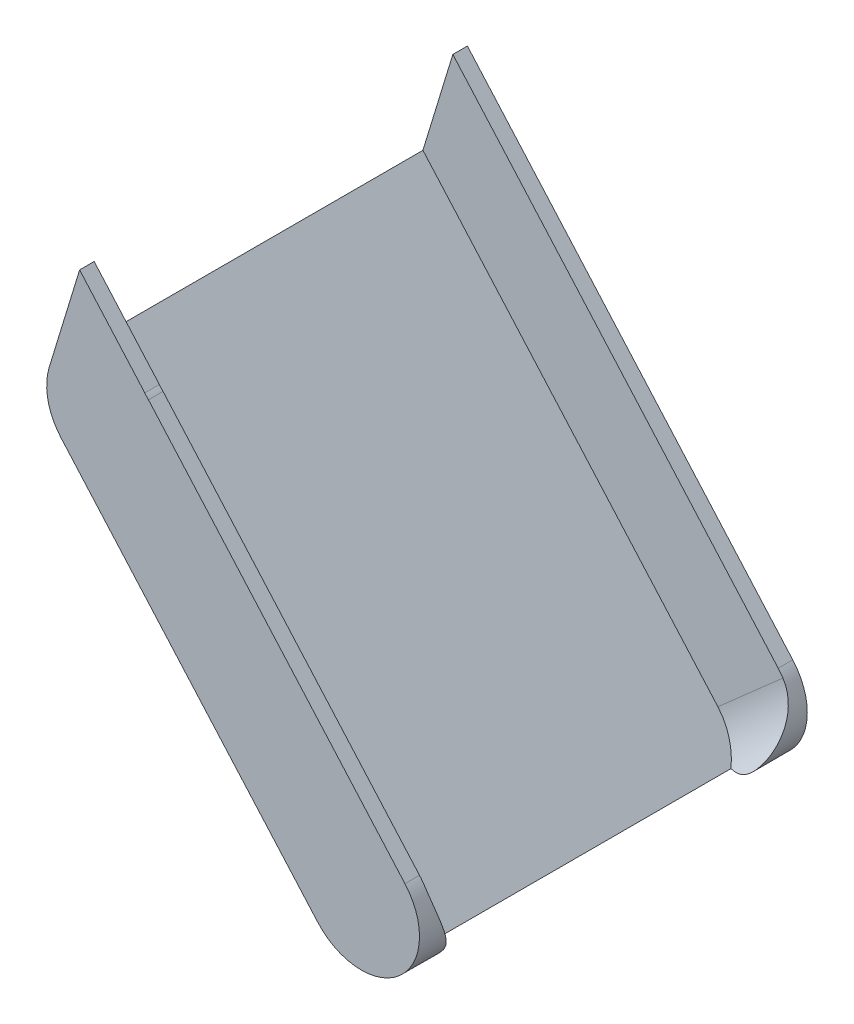
ISO-10303-21;
HEADER;
FILE_DESCRIPTION(('STEP AP214'),'2;1');
FILE_NAME('part.step','',(''),(''),'','','');
FILE_SCHEMA(('AUTOMOTIVE_DESIGN { 1 0 10303 214 1 1 1 1 }'));
ENDSEC;
DATA;
#1=APPLICATION_CONTEXT('core data for automotive mechanical design processes');
#2=APPLICATION_PROTOCOL_DEFINITION('international standard','automotive_design',2000,#1);
#3=PRODUCT_CONTEXT('',#1,'mechanical');
#4=PRODUCT('Part','Part','',(#3));
#5=PRODUCT_RELATED_PRODUCT_CATEGORY('part','',(#4));
#6=PRODUCT_DEFINITION_FORMATION('','',#4);
#7=PRODUCT_DEFINITION_CONTEXT('part definition',#1,'design');
#8=PRODUCT_DEFINITION('design','',#6,#7);
#9=PRODUCT_DEFINITION_SHAPE('','',#8);
#10=(LENGTH_UNIT() NAMED_UNIT(*) SI_UNIT(.MILLI.,.METRE.));
#11=(NAMED_UNIT(*) PLANE_ANGLE_UNIT() SI_UNIT($,.RADIAN.));
#12=(NAMED_UNIT(*) SI_UNIT($,.STERADIAN.) SOLID_ANGLE_UNIT());
#13=UNCERTAINTY_MEASURE_WITH_UNIT(LENGTH_MEASURE(1.E-05),#10,'distance_accuracy_value','');
#14=(GEOMETRIC_REPRESENTATION_CONTEXT(3) GLOBAL_UNCERTAINTY_ASSIGNED_CONTEXT((#13)) GLOBAL_UNIT_ASSIGNED_CONTEXT((#10,
#11,#12)) REPRESENTATION_CONTEXT('',''));
#15=CARTESIAN_POINT('',(0.,0.,0.));
#16=DIRECTION('',(0.,0.,1.));
#17=DIRECTION('',(1.,0.,0.));
#18=AXIS2_PLACEMENT_3D('',#15,#16,#17);
#19=CARTESIAN_POINT('',(0.,0.,200.));
#20=DIRECTION('',(0.,0.,-1.));
#21=DIRECTION('',(-1.,0.,0.));
#22=AXIS2_PLACEMENT_3D('',#19,#20,#21);
#23=CYLINDRICAL_SURFACE('',#22,30.);
#24=CARTESIAN_POINT('',(0.,0.,192.5));
#25=DIRECTION('',(0.,0.,1.));
#26=DIRECTION('',(0.,-1.,0.));
#27=AXIS2_PLACEMENT_3D('',#24,#25,#26);
#28=CIRCLE('',#27,30.);
#29=CARTESIAN_POINT('',(22.5,19.8431348329845,192.5));
#30=VERTEX_POINT('',#29);
#31=CARTESIAN_POINT('',(20.481002419258,21.9209611993258,192.5));
#32=VERTEX_POINT('',#31);
#33=EDGE_CURVE('E262',#30,#32,#28,.T.);
#34=ORIENTED_EDGE('',*,*,#33,.T.);
#35=DIRECTION('',(0.,0.,-1.));
#36=VECTOR('',#35,1.);
#37=CARTESIAN_POINT('',(20.481002419258,21.9209611993258,200.));
#38=LINE('',#37,#36);
#39=CARTESIAN_POINT('',(20.481002419258,21.9209611993258,200.));
#40=VERTEX_POINT('',#39);
#41=EDGE_CURVE('E82',#32,#40,#38,.F.);
#42=ORIENTED_EDGE('',*,*,#41,.T.);
#43=CARTESIAN_POINT('',(0.,0.,200.));
#44=DIRECTION('',(0.,0.,1.));
#45=DIRECTION('',(1.,0.,0.));
#46=AXIS2_PLACEMENT_3D('',#43,#44,#45);
#47=CIRCLE('',#46,30.);
#48=CARTESIAN_POINT('',(22.5,19.8431348329845,200.));
#49=VERTEX_POINT('',#48);
#50=EDGE_CURVE('E270',#49,#40,#47,.T.);
#51=ORIENTED_EDGE('',*,*,#50,.F.);
#52=DIRECTION('',(0.,0.,-1.));
#53=VECTOR('',#52,1.);
#54=CARTESIAN_POINT('',(22.5,19.8431348329845,200.));
#55=LINE('',#54,#53);
#56=EDGE_CURVE('E282',#49,#30,#55,.T.);
#57=ORIENTED_EDGE('',*,*,#56,.T.);
#58=EDGE_LOOP('',(#34,#42,#51,#57));
#59=FACE_BOUND('',#58,.T.);
#60=ADVANCED_FACE('F52',(#59),#23,.T.);
#61=CARTESIAN_POINT('',(22.5,19.8431348329845,200.));
#62=DIRECTION('',(-0.75,-0.661437827766148,0.));
#63=DIRECTION('',(0.661437827766148,-0.75,0.));
#64=AXIS2_PLACEMENT_3D('',#61,#62,#63);
#65=PLANE('',#64);
#66=DIRECTION('',(0.,0.,-1.));
#67=VECTOR('',#66,1.);
#68=CARTESIAN_POINT('',(154.78756555323,-130.156865167016,200.));
#69=LINE('',#68,#67);
#70=CARTESIAN_POINT('',(154.78756555323,-130.156865167016,200.));
#71=VERTEX_POINT('',#70);
#72=CARTESIAN_POINT('',(154.78756555323,-130.156865167016,192.5));
#73=VERTEX_POINT('',#72);
#74=EDGE_CURVE('E299',#71,#73,#69,.T.);
#75=ORIENTED_EDGE('',*,*,#74,.T.);
#76=DIRECTION('',(-0.661437827766148,0.75,0.));
#77=VECTOR('',#76,1.);
#78=CARTESIAN_POINT('',(22.5,19.8431348329845,192.5));
#79=LINE('',#78,#77);
#80=EDGE_CURVE('E315',#73,#30,#79,.T.);
#81=ORIENTED_EDGE('',*,*,#80,.T.);
#82=ORIENTED_EDGE('',*,*,#56,.F.);
#83=DIRECTION('',(-0.661437827766148,0.75,0.));
#84=VECTOR('',#83,1.);
#85=CARTESIAN_POINT('',(22.5,19.8431348329845,200.));
#86=LINE('',#85,#84);
#87=EDGE_CURVE('E279',#71,#49,#86,.T.);
#88=ORIENTED_EDGE('',*,*,#87,.F.);
#89=EDGE_LOOP('',(#75,#81,#82,#88));
#90=FACE_BOUND('',#89,.T.);
#91=ADVANCED_FACE('F360',(#90),#65,.F.);
#92=CARTESIAN_POINT('',(-28.6921965574017,8.76115612869827,200.));
#93=VERTEX_POINT('',#92);
#94=CARTESIAN_POINT('',(-22.5,-19.8431348329844,200.));
#95=VERTEX_POINT('',#94);
#96=EDGE_CURVE('E74',#93,#95,#47,.T.);
#97=ORIENTED_EDGE('',*,*,#96,.F.);
#98=DIRECTION('',(0.,0.,-1.));
#99=VECTOR('',#98,1.);
#100=CARTESIAN_POINT('',(-28.6921965574017,8.76115612869826,200.));
#101=LINE('',#100,#99);
#102=CARTESIAN_POINT('',(-28.6921965574017,8.76115612869826,192.5));
#103=VERTEX_POINT('',#102);
#104=EDGE_CURVE('E179',#93,#103,#101,.T.);
#105=ORIENTED_EDGE('',*,*,#104,.T.);
#106=CARTESIAN_POINT('',(0.,0.,192.5));
#107=DIRECTION('',(0.,0.,1.));
#108=DIRECTION('',(1.,0.,0.));
#109=AXIS2_PLACEMENT_3D('',#106,#107,#108);
#110=CIRCLE('',#109,30.);
#111=CARTESIAN_POINT('',(-28.4346588560844,9.56400416865766,192.5));
#112=VERTEX_POINT('',#111);
#113=EDGE_CURVE('E210',#112,#103,#110,.T.);
#114=ORIENTED_EDGE('',*,*,#113,.F.);
#115=DIRECTION('',(0.,0.,-1.));
#116=VECTOR('',#115,1.);
#117=CARTESIAN_POINT('',(-28.4346588560844,9.56400416865766,200.));
#118=LINE('',#117,#116);
#119=CARTESIAN_POINT('',(-28.4346588560844,9.56400416865766,7.49999999999998));
#120=VERTEX_POINT('',#119);
#121=EDGE_CURVE('E265',#120,#112,#118,.F.);
#122=ORIENTED_EDGE('',*,*,#121,.F.);
#123=CARTESIAN_POINT('',(0.,0.,7.5));
#124=DIRECTION('',(0.,0.,-1.));
#125=DIRECTION('',(-1.,0.,0.));
#126=AXIS2_PLACEMENT_3D('',#123,#124,#125);
#127=CIRCLE('',#126,30.);
#128=CARTESIAN_POINT('',(-28.6921965574017,8.76115612869828,7.50000000000001));
#129=VERTEX_POINT('',#128);
#130=EDGE_CURVE('E215',#129,#120,#127,.T.);
#131=ORIENTED_EDGE('',*,*,#130,.F.);
#132=DIRECTION('',(0.,0.,-1.));
#133=VECTOR('',#132,1.);
#134=CARTESIAN_POINT('',(-28.6921965574017,8.76115612869828,7.5));
#135=LINE('',#134,#133);
#136=CARTESIAN_POINT('',(-28.6921965574017,8.76115612869828,0.));
#137=VERTEX_POINT('',#136);
#138=EDGE_CURVE('E223',#129,#137,#135,.T.);
#139=ORIENTED_EDGE('',*,*,#138,.T.);
#140=CARTESIAN_POINT('',(0.,0.,0.));
#141=DIRECTION('',(0.,0.,1.));
#142=DIRECTION('',(1.,0.,0.));
#143=AXIS2_PLACEMENT_3D('',#140,#141,#142);
#144=CIRCLE('',#143,30.);
#145=CARTESIAN_POINT('',(-22.5,-19.8431348329844,0.));
#146=VERTEX_POINT('',#145);
#147=EDGE_CURVE('E269',#137,#146,#144,.T.);
#148=ORIENTED_EDGE('',*,*,#147,.T.);
#149=DIRECTION('',(0.,0.,-1.));
#150=VECTOR('',#149,1.);
#151=CARTESIAN_POINT('',(-22.5,-19.8431348329844,200.));
#152=LINE('',#151,#150);
#153=EDGE_CURVE('E307',#95,#146,#152,.T.);
#154=ORIENTED_EDGE('',*,*,#153,.F.);
#155=EDGE_LOOP('',(#97,#105,#114,#122,#131,#139,#148,#154));
#156=FACE_BOUND('',#155,.T.);
#157=ADVANCED_FACE('F54',(#156),#23,.T.);
#158=CARTESIAN_POINT('',(-22.5,-19.8431348329844,200.));
#159=DIRECTION('',(0.75,0.661437827766148,0.));
#160=DIRECTION('',(-0.661437827766148,0.75,0.));
#161=AXIS2_PLACEMENT_3D('',#158,#159,#160);
#162=PLANE('',#161);
#163=DIRECTION('',(0.661437827766148,-0.75,0.));
#164=VECTOR('',#163,1.);
#165=CARTESIAN_POINT('',(-22.5,-19.8431348329844,0.));
#166=LINE('',#165,#164);
#167=CARTESIAN_POINT('',(109.78756555323,-169.843134832984,0.));
#168=VERTEX_POINT('',#167);
#169=EDGE_CURVE('E285',#146,#168,#166,.T.);
#170=ORIENTED_EDGE('',*,*,#169,.T.);
#171=DIRECTION('',(0.,0.,-1.));
#172=VECTOR('',#171,1.);
#173=CARTESIAN_POINT('',(109.78756555323,-169.843134832984,200.));
#174=LINE('',#173,#172);
#175=CARTESIAN_POINT('',(109.78756555323,-169.843134832984,200.));
#176=VERTEX_POINT('',#175);
#177=EDGE_CURVE('E303',#176,#168,#174,.T.);
#178=ORIENTED_EDGE('',*,*,#177,.F.);
#179=DIRECTION('',(0.661437827766148,-0.75,0.));
#180=VECTOR('',#179,1.);
#181=CARTESIAN_POINT('',(-22.5,-19.8431348329844,200.));
#182=LINE('',#181,#180);
#183=EDGE_CURVE('E273',#95,#176,#182,.T.);
#184=ORIENTED_EDGE('',*,*,#183,.F.);
#185=ORIENTED_EDGE('',*,*,#153,.T.);
#186=EDGE_LOOP('',(#170,#178,#184,#185));
#187=FACE_BOUND('',#186,.T.);
#188=ADVANCED_FACE('F364',(#187),#162,.F.);
#189=CARTESIAN_POINT('',(132.28756555323,-150.,200.));
#190=DIRECTION('',(0.,0.,-1.));
#191=DIRECTION('',(-1.,0.,0.));
#192=AXIS2_PLACEMENT_3D('',#189,#190,#191);
#193=CYLINDRICAL_SURFACE('',#192,30.);
#194=CARTESIAN_POINT('',(138.222224409314,-179.407139001642,184.743459000681));
#195=CARTESIAN_POINT('',(138.548012254945,-179.341386533198,184.609437597091));
#196=CARTESIAN_POINT('',(138.873144530342,-179.270142264889,184.47657309602));
#197=CARTESIAN_POINT('',(139.522049080567,-179.116550331891,184.213882521117));
#198=CARTESIAN_POINT('',(139.84582121484,-179.034201547423,184.084056755261));
#199=CARTESIAN_POINT('',(140.81576697524,-178.770111171289,183.699931863997));
#200=CARTESIAN_POINT('',(141.45972094364,-178.571496198665,183.451338090733));
#201=CARTESIAN_POINT('',(142.746951696473,-178.125969634947,182.973678570962));
#202=CARTESIAN_POINT('',(143.390145151942,-177.878556885952,182.744854263895));
#203=CARTESIAN_POINT('',(144.666188148559,-177.335871880052,182.317769720596));
#204=CARTESIAN_POINT('',(145.299043184382,-177.040626021157,182.119492743068));
#205=CARTESIAN_POINT('',(146.446350967326,-176.455080726993,181.791771413933));
#206=CARTESIAN_POINT('',(146.962894088251,-176.172222669162,181.656360858745));
#207=CARTESIAN_POINT('',(147.983848777963,-175.5729722684,181.417312398736));
#208=CARTESIAN_POINT('',(148.488260742145,-175.256581020254,181.313673457072));
#209=CARTESIAN_POINT('',(149.479014436211,-174.592839478979,181.14287844379));
#210=CARTESIAN_POINT('',(149.96543458577,-174.2456536735,181.075540698187));
#211=CARTESIAN_POINT('',(150.91903073367,-173.520780660837,180.979625763662));
#212=CARTESIAN_POINT('',(151.386207386287,-173.143094491954,180.951047255879));
#213=CARTESIAN_POINT('',(152.299265679182,-172.358346776767,180.934007624497));
#214=CARTESIAN_POINT('',(152.74505411861,-171.951173197548,180.945708307323));
#215=CARTESIAN_POINT('',(153.609788450287,-171.112218565252,181.009003034769));
#216=CARTESIAN_POINT('',(154.02873412013,-170.680437308342,181.060597409885));
#217=CARTESIAN_POINT('',(154.838094648156,-169.794808469189,181.20140337379));
#218=CARTESIAN_POINT('',(155.228435440389,-169.340908341442,181.290708830146));
#219=CARTESIAN_POINT('',(155.977739498108,-168.415491794038,181.503061675144));
#220=CARTESIAN_POINT('',(156.33669826811,-167.943972864248,181.626113887606));
#221=CARTESIAN_POINT('',(157.124777868978,-166.843325443954,181.942378058059));
#222=CARTESIAN_POINT('',(157.542867026111,-166.209156174895,182.145568676512));
#223=CARTESIAN_POINT('',(158.324664516904,-164.921048736369,182.590219371487));
#224=CARTESIAN_POINT('',(158.688353545296,-164.267103647455,182.831692971373));
#225=CARTESIAN_POINT('',(159.362578807913,-162.942061756354,183.342983044068));
#226=CARTESIAN_POINT('',(159.673045839441,-162.270943908002,183.612835692914));
#227=CARTESIAN_POINT('',(160.241299907988,-160.914640469561,184.171476492907));
#228=CARTESIAN_POINT('',(160.499091271851,-160.229456040011,184.46026308622));
#229=CARTESIAN_POINT('',(160.97093472167,-158.82235702182,185.059078420497));
#230=CARTESIAN_POINT('',(161.183151480698,-158.099994188012,185.369496674612));
#231=CARTESIAN_POINT('',(161.552477151419,-156.643022042474,185.994354309813));
#232=CARTESIAN_POINT('',(161.709584174533,-155.908412311953,186.308793828323));
#233=CARTESIAN_POINT('',(161.96842643159,-154.428397393537,186.934663761585));
#234=CARTESIAN_POINT('',(162.07017269125,-153.682994385626,187.246094763373));
#235=CARTESIAN_POINT('',(162.217540512698,-152.182799614652,187.859547711104));
#236=CARTESIAN_POINT('',(162.263163125237,-151.42800802763,188.161569833098));
#237=CARTESIAN_POINT('',(162.297067603437,-149.90908836222,188.750769592609));
#238=CARTESIAN_POINT('',(162.285202961579,-149.144941384578,189.03790741508));
#239=CARTESIAN_POINT('',(162.202212622709,-147.611885994906,189.590366273921));
#240=CARTESIAN_POINT('',(162.131086226104,-146.842977526771,189.855687052696));
#241=CARTESIAN_POINT('',(161.928149172684,-145.305822544422,190.357757111329));
#242=CARTESIAN_POINT('',(161.796485322219,-144.537578907991,190.594573771967));
#243=CARTESIAN_POINT('',(161.471051167203,-143.00442966512,191.034277585849));
#244=CARTESIAN_POINT('',(161.277284455352,-142.239523868177,191.237166700798));
#245=CARTESIAN_POINT('',(160.842984073452,-140.773410758444,191.589894985864));
#246=CARTESIAN_POINT('',(160.606813485717,-140.07157706969,191.742499218167));
#247=CARTESIAN_POINT('',(160.080223701196,-138.680976110965,192.00884022334));
#248=CARTESIAN_POINT('',(159.789819626352,-137.992205257508,192.12258780567));
#249=CARTESIAN_POINT('',(159.312995039548,-136.970441211248,192.261511804206));
#250=CARTESIAN_POINT('',(159.146328662426,-136.630228106484,192.302650800071));
#251=CARTESIAN_POINT('',(158.799701290757,-135.955411490699,192.373619829401));
#252=CARTESIAN_POINT('',(158.619740549481,-135.62080787296,192.403450078242));
#253=CARTESIAN_POINT('',(158.24664264774,-134.957687153639,192.451441220103));
#254=CARTESIAN_POINT('',(158.053491121132,-134.629177200073,192.469589158241));
#255=CARTESIAN_POINT('',(157.654590462422,-133.979400794097,192.493875758576));
#256=CARTESIAN_POINT('',(157.448840110345,-133.658135047294,192.500013255869));
#257=CARTESIAN_POINT('',(157.237009712174,-133.340911304645,192.5));
#258=B_SPLINE_CURVE_WITH_KNOTS('',3,(#194,#195,#196,#197,#198,#199,#200,#201,#202,#203,#204,
#205,#206,#207,#208,#209,#210,#211,#212,#213,#214,#215,#216,#217,#218,#219,#220,#221,#222,#223,
#224,#225,#226,#227,#228,#229,#230,#231,#232,#233,#234,#235,#236,#237,#238,#239,#240,#241,#242,
#243,#244,#245,#246,#247,#248,#249,#250,#251,#252,#253,#254,#255,#256,#257),.UNSPECIFIED.,.F.,
.F.,(4,2,2,2,2,2,2,2,2,2,2,2,2,2,2,2,2,2,2,2,2,2,2,2,2,2,2,2,2,2,2,4),(0.,1.07499202071178,
2.15009252462735,4.30309358128589,6.47948020403126,8.65466979435197,10.4658298380934,
12.2769307696713,14.0788816272408,15.8807711682297,17.6899075519009,19.4990589233498,
21.3127402918419,23.1266810464817,25.4819700214579,27.8380928575815,30.1972564153398,
32.5562261104931,34.9973263611785,37.438510258812,39.8792077891466,42.3198596238748,
44.7667347796928,47.2136388216453,49.6546400442074,52.0955000783567,54.3609002265948,
56.6256696531129,57.7685180715639,58.9113447231833,60.0554365178529,61.1996392733974),.UNSPECIFIED.);
#259=CARTESIAN_POINT('',(138.222224409314,-179.407139001642,184.743459000682));
#260=VERTEX_POINT('',#259);
#261=CARTESIAN_POINT('',(157.237009712174,-133.340911304645,192.5));
#262=VERTEX_POINT('',#261);
#263=EDGE_CURVE('E67',#260,#262,#258,.T.);
#264=ORIENTED_EDGE('',*,*,#263,.T.);
#265=CARTESIAN_POINT('',(132.28756555323,-150.,192.5));
#266=DIRECTION('',(0.,0.,1.));
#267=DIRECTION('',(0.,-1.,0.));
#268=AXIS2_PLACEMENT_3D('',#265,#266,#267);
#269=CIRCLE('',#268,30.);
#270=EDGE_CURVE('E258',#262,#73,#269,.T.);
#271=ORIENTED_EDGE('',*,*,#270,.T.);
#272=ORIENTED_EDGE('',*,*,#74,.F.);
#273=CARTESIAN_POINT('',(132.28756555323,-150.,200.));
#274=DIRECTION('',(0.,0.,1.));
#275=DIRECTION('',(1.,0.,0.));
#276=AXIS2_PLACEMENT_3D('',#273,#274,#275);
#277=CIRCLE('',#276,30.);
#278=EDGE_CURVE('E276',#176,#71,#277,.T.);
#279=ORIENTED_EDGE('',*,*,#278,.F.);
#280=ORIENTED_EDGE('',*,*,#177,.T.);
#281=CARTESIAN_POINT('',(132.28756555323,-150.,0.));
#282=DIRECTION('',(0.,0.,1.));
#283=DIRECTION('',(1.,0.,0.));
#284=AXIS2_PLACEMENT_3D('',#281,#282,#283);
#285=CIRCLE('',#284,30.);
#286=CARTESIAN_POINT('',(154.78756555323,-130.156865167016,0.));
#287=VERTEX_POINT('',#286);
#288=EDGE_CURVE('E288',#168,#287,#285,.T.);
#289=ORIENTED_EDGE('',*,*,#288,.T.);
#290=CARTESIAN_POINT('',(154.78756555323,-130.156865167016,7.49999999999998));
#291=VERTEX_POINT('',#290);
#292=EDGE_CURVE('E298',#291,#287,#69,.T.);
#293=ORIENTED_EDGE('',*,*,#292,.F.);
#294=CARTESIAN_POINT('',(132.28756555323,-150.,7.49999999999995));
#295=DIRECTION('',(0.,0.,-1.));
#296=DIRECTION('',(0.,1.,0.));
#297=AXIS2_PLACEMENT_3D('',#294,#295,#296);
#298=CIRCLE('',#297,30.);
#299=CARTESIAN_POINT('',(157.237009712174,-133.340911304645,7.49999999999995));
#300=VERTEX_POINT('',#299);
#301=EDGE_CURVE('E251',#291,#300,#298,.T.);
#302=ORIENTED_EDGE('',*,*,#301,.T.);
#303=CARTESIAN_POINT('',(157.237009712174,-133.340911304645,7.49999999999994));
#304=CARTESIAN_POINT('',(157.441211289943,-133.646712920108,7.49998852077895));
#305=CARTESIAN_POINT('',(157.639764705172,-133.956270581635,7.50569114907807));
#306=CARTESIAN_POINT('',(158.025178779514,-134.582148542819,7.52826808463735));
#307=CARTESIAN_POINT('',(158.212040425238,-134.898468268827,7.54514144785827));
#308=CARTESIAN_POINT('',(158.573540706855,-135.5368753287,7.58978259871587));
#309=CARTESIAN_POINT('',(158.748190567238,-135.85895701509,7.61754022273261));
#310=CARTESIAN_POINT('',(159.085160237062,-136.508416714167,7.68360878414362));
#311=CARTESIAN_POINT('',(159.247479849818,-136.835794811237,7.72191988983631));
#312=CARTESIAN_POINT('',(159.713177298717,-137.819718117498,7.85146086220604));
#313=CARTESIAN_POINT('',(159.998172391533,-138.48314775819,7.95766567738335));
#314=CARTESIAN_POINT('',(160.5176820354,-139.822717675914,8.2066909082165));
#315=CARTESIAN_POINT('',(160.752186580468,-140.498860443559,8.34951856935249));
#316=CARTESIAN_POINT('',(161.169853327804,-141.856535344243,8.66721278577139));
#317=CARTESIAN_POINT('',(161.353199555201,-142.538038850227,8.8419606630567));
#318=CARTESIAN_POINT('',(161.670197591011,-143.904668022491,9.21961945824549));
#319=CARTESIAN_POINT('',(161.80385123697,-144.589793553884,9.42252933438558));
#320=CARTESIAN_POINT('',(162.022586376551,-145.961255270441,9.85251309668439));
#321=CARTESIAN_POINT('',(162.107597614176,-146.647591777724,10.0796213750981));
#322=CARTESIAN_POINT('',(162.229905537631,-148.017721022056,10.5534117553391));
#323=CARTESIAN_POINT('',(162.267199337917,-148.701513602778,10.8000950399378));
#324=CARTESIAN_POINT('',(162.296888720292,-150.144584941143,11.3386325449678));
#325=CARTESIAN_POINT('',(162.283482419591,-150.90327449713,11.6323858362497));
#326=CARTESIAN_POINT('',(162.199967437079,-152.412346793006,12.232802678746));
#327=CARTESIAN_POINT('',(162.129855275991,-153.162729020322,12.539467021044));
#328=CARTESIAN_POINT('',(161.933773962392,-154.655109107874,13.1601428709425));
#329=CARTESIAN_POINT('',(161.807677690128,-155.397083923266,13.4741695498697));
#330=CARTESIAN_POINT('',(161.500162575887,-156.869491589088,14.102211907047));
#331=CARTESIAN_POINT('',(161.318740580327,-157.599923779088,14.4162275836493));
#332=CARTESIAN_POINT('',(160.859330424358,-159.19064970699,15.0981273157432));
#333=CARTESIAN_POINT('',(160.56936263152,-160.048198288287,15.4644454155982));
#334=CARTESIAN_POINT('',(159.908864516466,-161.742713883916,16.1724812329614));
#335=CARTESIAN_POINT('',(159.538302539738,-162.57967266713,16.5141892140996));
#336=CARTESIAN_POINT('',(158.715942826284,-164.226160848823,17.1548359086578));
#337=CARTESIAN_POINT('',(158.264448906357,-165.035779815236,17.4539273139543));
#338=CARTESIAN_POINT('',(157.52494185089,-166.226306019077,17.85673913932));
#339=CARTESIAN_POINT('',(157.268133658594,-166.619069334876,17.9833463153205));
#340=CARTESIAN_POINT('',(156.733717603215,-167.395623589089,18.2187990448344));
#341=CARTESIAN_POINT('',(156.456113833129,-167.779416273699,18.3276480801827));
#342=CARTESIAN_POINT('',(155.820076844214,-168.615896187132,18.5457417371045));
#343=CARTESIAN_POINT('',(155.456879675289,-169.066209106302,18.6503100554705));
#344=CARTESIAN_POINT('',(154.701555262317,-169.948690763807,18.8257867122661));
#345=CARTESIAN_POINT('',(154.309433857542,-170.380863136891,18.8967018232881));
#346=CARTESIAN_POINT('',(153.49904703132,-171.22295241501,19.0017419194316));
#347=CARTESIAN_POINT('',(153.080839751373,-171.632915258996,19.0359458318883));
#348=CARTESIAN_POINT('',(152.220340613142,-172.428279820459,19.0662588996712));
#349=CARTESIAN_POINT('',(151.778048183541,-172.813680954844,19.06236715095));
#350=CARTESIAN_POINT('',(150.873488779126,-173.556431377676,19.0167037566736));
#351=CARTESIAN_POINT('',(150.411252098404,-173.913821038853,18.9749877598057));
#352=CARTESIAN_POINT('',(149.469816548947,-174.598968763064,18.8556477667444));
#353=CARTESIAN_POINT('',(148.990617130377,-174.926725864355,18.7780226055955));
#354=CARTESIAN_POINT('',(148.016485548558,-175.552648412751,18.5896895398523));
#355=CARTESIAN_POINT('',(147.521491802054,-175.850672661815,18.4788329438128));
#356=CARTESIAN_POINT('',(146.520840285414,-176.41484241602,18.2283251370881));
#357=CARTESIAN_POINT('',(146.015182267841,-176.680987180518,18.0886732576183));
#358=CARTESIAN_POINT('',(144.911806871322,-177.222521749375,17.7601393380237));
#359=CARTESIAN_POINT('',(144.312604074024,-177.492256679326,17.5669390696306));
#360=CARTESIAN_POINT('',(143.105440467094,-177.989283548421,17.154577059307));
#361=CARTESIAN_POINT('',(142.497476092477,-178.216557653636,16.9354044716475));
#362=CARTESIAN_POINT('',(141.280918637378,-178.627392849292,16.479967020638));
#363=CARTESIAN_POINT('',(140.67239318857,-178.811370017629,16.2438959164294));
#364=CARTESIAN_POINT('',(139.755994853618,-179.057227202419,15.8799781957576));
#365=CARTESIAN_POINT('',(139.450083964312,-179.134129947873,15.7571022677435));
#366=CARTESIAN_POINT('',(138.837051363811,-179.278034369471,15.5086753317215));
#367=CARTESIAN_POINT('',(138.529929754357,-179.345036860106,15.3831245447467));
#368=CARTESIAN_POINT('',(138.222224409314,-179.407139001642,15.2565409993184));
#369=B_SPLINE_CURVE_WITH_KNOTS('',3,(#303,#304,#305,#306,#307,#308,#309,#310,#311,#312,#313,
#314,#315,#316,#317,#318,#319,#320,#321,#322,#323,#324,#325,#326,#327,#328,#329,#330,#331,#332,
#333,#334,#335,#336,#337,#338,#339,#340,#341,#342,#343,#344,#345,#346,#347,#348,#349,#350,#351,
#352,#353,#354,#355,#356,#357,#358,#359,#360,#361,#362,#363,#364,#365,#366,#367,#368),
.UNSPECIFIED.,.F.,.F.,(4,2,2,2,2,2,2,2,2,2,2,2,2,2,2,2,2,2,2,2,2,2,2,2,2,2,2,2,2,2,2,2,4),(0.,
1.10301190067732,2.2059305976727,3.30782184285378,4.40973066112646,6.59602335174547,
8.78274891366606,10.9615039523641,13.140178416434,15.3219917271895,17.5039369691418,
19.9427264608918,22.3816655998233,24.8261712415553,27.270816246961,30.196754896639,
33.1238448324155,36.040168275003,37.4976026966259,38.954751015065,40.7165837057309,
42.478061683101,44.2357449333489,45.9934698952443,47.7486130040757,49.5038130567773,
51.2669869093538,53.0302017171246,55.0828734605914,57.1364054159412,59.1693142023253,
60.1847335087856,61.2000692304906),.UNSPECIFIED.);
#370=CARTESIAN_POINT('',(138.222224409314,-179.407139001642,15.2565409993184));
#371=VERTEX_POINT('',#370);
#372=EDGE_CURVE('E13',#300,#371,#369,.T.);
#373=ORIENTED_EDGE('',*,*,#372,.T.);
#374=DIRECTION('',(0.,0.,-1.));
#375=VECTOR('',#374,1.);
#376=CARTESIAN_POINT('',(138.222224409314,-179.407139001642,200.));
#377=LINE('',#376,#375);
#378=EDGE_CURVE('E319',#260,#371,#377,.T.);
#379=ORIENTED_EDGE('',*,*,#378,.F.);
#380=EDGE_LOOP('',(#264,#271,#272,#279,#280,#289,#293,#302,#373,#379));
#381=FACE_BOUND('',#380,.T.);
#382=ADVANCED_FACE('F328',(#381),#193,.T.);
#383=DIRECTION('',(-0.661437827766148,0.75,0.));
#384=VECTOR('',#383,1.);
#385=CARTESIAN_POINT('',(22.5,19.8431348329845,0.));
#386=LINE('',#385,#384);
#387=CARTESIAN_POINT('',(-13.0126320049643,60.1106745557652,0.));
#388=VERTEX_POINT('',#387);
#389=EDGE_CURVE('E292',#287,#388,#386,.T.);
#390=ORIENTED_EDGE('',*,*,#389,.T.);
#391=DIRECTION('',(0.,0.,-1.));
#392=VECTOR('',#391,1.);
#393=CARTESIAN_POINT('',(-13.0126320049643,60.1106745557652,7.5));
#394=LINE('',#393,#392);
#395=CARTESIAN_POINT('',(-13.0126320049643,60.1106745557652,7.5));
#396=VERTEX_POINT('',#395);
#397=EDGE_CURVE('E227',#396,#388,#394,.T.);
#398=ORIENTED_EDGE('',*,*,#397,.F.);
#399=DIRECTION('',(0.661437827766148,-0.75,0.));
#400=VECTOR('',#399,1.);
#401=CARTESIAN_POINT('',(22.5,19.8431348329845,7.49999999999998));
#402=LINE('',#401,#400);
#403=EDGE_CURVE('E311',#396,#291,#402,.T.);
#404=ORIENTED_EDGE('',*,*,#403,.T.);
#405=ORIENTED_EDGE('',*,*,#292,.T.);
#406=EDGE_LOOP('',(#390,#398,#404,#405));
#407=FACE_BOUND('',#406,.T.);
#408=ADVANCED_FACE('F355',(#407),#65,.F.);
#409=CARTESIAN_POINT('',(0.,0.,200.));
#410=DIRECTION('',(0.,0.,1.));
#411=DIRECTION('',(1.,0.,0.));
#412=AXIS2_PLACEMENT_3D('',#409,#410,#411);
#413=PLANE('',#412);
#414=ORIENTED_EDGE('',*,*,#50,.T.);
#415=DIRECTION('',(-0.966004920238332,-0.258523681846235,0.));
#416=VECTOR('',#415,1.);
#417=CARTESIAN_POINT('',(-28.6921965574017,8.76115612869826,200.));
#418=LINE('',#417,#416);
#419=CARTESIAN_POINT('',(20.6319117683024,21.9613477850695,200.));
#420=VERTEX_POINT('',#419);
#421=EDGE_CURVE('E186',#420,#40,#418,.T.);
#422=ORIENTED_EDGE('',*,*,#421,.F.);
#423=DIRECTION('',(0.661437827766148,-0.749999999999999,0.));
#424=VECTOR('',#423,1.);
#425=CARTESIAN_POINT('',(20.6319117683024,21.9613477850695,200.));
#426=LINE('',#425,#424);
#427=CARTESIAN_POINT('',(-13.0126320049642,60.1106745557652,200.));
#428=VERTEX_POINT('',#427);
#429=EDGE_CURVE('E171',#428,#420,#426,.T.);
#430=ORIENTED_EDGE('',*,*,#429,.F.);
#431=DIRECTION('',(0.292038537623276,0.956406551913389,0.));
#432=VECTOR('',#431,1.);
#433=CARTESIAN_POINT('',(-13.0126320049642,60.1106745557652,200.));
#434=LINE('',#433,#432);
#435=EDGE_CURVE('E182',#93,#428,#434,.T.);
#436=ORIENTED_EDGE('',*,*,#435,.F.);
#437=ORIENTED_EDGE('',*,*,#96,.T.);
#438=ORIENTED_EDGE('',*,*,#183,.T.);
#439=ORIENTED_EDGE('',*,*,#278,.T.);
#440=ORIENTED_EDGE('',*,*,#87,.T.);
#441=EDGE_LOOP('',(#414,#422,#430,#436,#437,#438,#439,#440));
#442=FACE_BOUND('',#441,.T.);
#443=ADVANCED_FACE('F189',(#442),#413,.T.);
#444=CARTESIAN_POINT('',(0.,0.,0.));
#445=DIRECTION('',(0.,0.,1.));
#446=DIRECTION('',(1.,0.,0.));
#447=AXIS2_PLACEMENT_3D('',#444,#445,#446);
#448=PLANE('',#447);
#449=ORIENTED_EDGE('',*,*,#147,.F.);
#450=DIRECTION('',(0.292038537623276,0.956406551913389,0.));
#451=VECTOR('',#450,1.);
#452=CARTESIAN_POINT('',(-28.6921965574017,8.76115612869828,0.));
#453=LINE('',#452,#451);
#454=EDGE_CURVE('E214',#137,#388,#453,.T.);
#455=ORIENTED_EDGE('',*,*,#454,.T.);
#456=ORIENTED_EDGE('',*,*,#389,.F.);
#457=ORIENTED_EDGE('',*,*,#288,.F.);
#458=ORIENTED_EDGE('',*,*,#169,.F.);
#459=EDGE_LOOP('',(#449,#455,#456,#457,#458));
#460=FACE_BOUND('',#459,.T.);
#461=ADVANCED_FACE('F351',(#460),#448,.F.);
#462=CARTESIAN_POINT('',(123.688733793354,-162.927709636704,42.5));
#463=DIRECTION('',(0.75,0.661437827766148,0.));
#464=DIRECTION('',(-0.661437827766148,0.75,0.));
#465=AXIS2_PLACEMENT_3D('',#462,#463,#464);
#466=CYLINDRICAL_SURFACE('',#465,35.);
#467=DIRECTION('',(0.75,0.661437827766148,0.));
#468=VECTOR('',#467,1.);
#469=CARTESIAN_POINT('',(123.688733793354,-162.927709636704,7.49999999999996));
#470=LINE('',#469,#468);
#471=CARTESIAN_POINT('',(123.688733793354,-162.927709636704,7.49999999999996));
#472=VERTEX_POINT('',#471);
#473=EDGE_CURVE('E246',#472,#300,#470,.T.);
#474=ORIENTED_EDGE('',*,*,#473,.F.);
#475=CARTESIAN_POINT('',(123.688733793354,-162.927709636704,42.5));
#476=DIRECTION('',(0.75,0.661437827766148,0.));
#477=DIRECTION('',(-0.661437827766148,0.75,0.));
#478=AXIS2_PLACEMENT_3D('',#475,#476,#477);
#479=CIRCLE('',#478,35.);
#480=EDGE_CURVE('E231',#371,#472,#479,.T.);
#481=ORIENTED_EDGE('',*,*,#480,.F.);
#482=ORIENTED_EDGE('',*,*,#372,.F.);
#483=EDGE_LOOP('',(#474,#481,#482));
#484=FACE_BOUND('',#483,.T.);
#485=ADVANCED_FACE('F337',(#484),#466,.F.);
#486=CARTESIAN_POINT('',(123.688733793354,-162.927709636704,157.5));
#487=DIRECTION('',(0.75,0.661437827766148,0.));
#488=DIRECTION('',(-0.661437827766148,0.75,0.));
#489=AXIS2_PLACEMENT_3D('',#486,#487,#488);
#490=CYLINDRICAL_SURFACE('',#489,35.);
#491=CARTESIAN_POINT('',(123.688733793354,-162.927709636704,157.5));
#492=DIRECTION('',(0.75,0.661437827766148,0.));
#493=DIRECTION('',(0.661437827766148,-0.75,0.));
#494=AXIS2_PLACEMENT_3D('',#491,#492,#493);
#495=CIRCLE('',#494,35.);
#496=CARTESIAN_POINT('',(123.688733793354,-162.927709636704,192.5));
#497=VERTEX_POINT('',#496);
#498=EDGE_CURVE('E242',#497,#260,#495,.T.);
#499=ORIENTED_EDGE('',*,*,#498,.F.);
#500=DIRECTION('',(0.75,0.661437827766148,0.));
#501=VECTOR('',#500,1.);
#502=CARTESIAN_POINT('',(123.688733793354,-162.927709636704,192.5));
#503=LINE('',#502,#501);
#504=EDGE_CURVE('E247',#497,#262,#503,.T.);
#505=ORIENTED_EDGE('',*,*,#504,.T.);
#506=ORIENTED_EDGE('',*,*,#263,.F.);
#507=EDGE_LOOP('',(#499,#505,#506));
#508=FACE_BOUND('',#507,.T.);
#509=ADVANCED_FACE('F331',(#508),#490,.F.);
#510=CARTESIAN_POINT('',(123.688733793354,-162.927709636704,42.5));
#511=DIRECTION('',(0.75,0.661437827766148,0.));
#512=DIRECTION('',(-0.661437827766148,0.75,0.));
#513=AXIS2_PLACEMENT_3D('',#510,#511,#512);
#514=PLANE('',#513);
#515=ORIENTED_EDGE('',*,*,#121,.T.);
#516=DIRECTION('',(0.661437827766148,-0.75,0.));
#517=VECTOR('',#516,1.);
#518=CARTESIAN_POINT('',(-45.1959283088476,28.5694972956956,192.5));
#519=LINE('',#518,#517);
#520=EDGE_CURVE('E239',#112,#497,#519,.T.);
#521=ORIENTED_EDGE('',*,*,#520,.T.);
#522=ORIENTED_EDGE('',*,*,#498,.T.);
#523=ORIENTED_EDGE('',*,*,#378,.T.);
#524=ORIENTED_EDGE('',*,*,#480,.T.);
#525=DIRECTION('',(-0.661437827766148,0.75,0.));
#526=VECTOR('',#525,1.);
#527=CARTESIAN_POINT('',(-45.1959283088476,28.5694972956956,7.49999999999998));
#528=LINE('',#527,#526);
#529=EDGE_CURVE('E236',#472,#120,#528,.T.);
#530=ORIENTED_EDGE('',*,*,#529,.T.);
#531=EDGE_LOOP('',(#515,#521,#522,#523,#524,#530));
#532=FACE_BOUND('',#531,.T.);
#533=ADVANCED_FACE('F336',(#532),#514,.T.);
#534=CARTESIAN_POINT('',(-45.1959283088476,28.5694972956956,192.5));
#535=DIRECTION('',(0.,0.,1.));
#536=DIRECTION('',(0.,-1.,0.));
#537=AXIS2_PLACEMENT_3D('',#534,#535,#536);
#538=PLANE('',#537);
#539=ORIENTED_EDGE('',*,*,#504,.F.);
#540=ORIENTED_EDGE('',*,*,#520,.F.);
#541=ORIENTED_EDGE('',*,*,#113,.T.);
#542=DIRECTION('',(0.292038537623276,0.956406551913389,0.));
#543=VECTOR('',#542,1.);
#544=CARTESIAN_POINT('',(-13.0126320049642,60.1106745557652,192.5));
#545=LINE('',#544,#543);
#546=CARTESIAN_POINT('',(-13.0126320049642,60.1106745557652,192.5));
#547=VERTEX_POINT('',#546);
#548=EDGE_CURVE('E201',#103,#547,#545,.T.);
#549=ORIENTED_EDGE('',*,*,#548,.T.);
#550=DIRECTION('',(0.661437827766148,-0.749999999999999,0.));
#551=VECTOR('',#550,1.);
#552=CARTESIAN_POINT('',(20.6319117683024,21.9613477850695,192.5));
#553=LINE('',#552,#551);
#554=CARTESIAN_POINT('',(20.6319117683024,21.9613477850695,192.5));
#555=VERTEX_POINT('',#554);
#556=EDGE_CURVE('E173',#547,#555,#553,.T.);
#557=ORIENTED_EDGE('',*,*,#556,.T.);
#558=DIRECTION('',(-0.966004920238332,-0.258523681846235,0.));
#559=VECTOR('',#558,1.);
#560=CARTESIAN_POINT('',(-28.6921965574017,8.76115612869826,192.5));
#561=LINE('',#560,#559);
#562=EDGE_CURVE('E197',#555,#32,#561,.T.);
#563=ORIENTED_EDGE('',*,*,#562,.T.);
#564=ORIENTED_EDGE('',*,*,#33,.F.);
#565=ORIENTED_EDGE('',*,*,#80,.F.);
#566=ORIENTED_EDGE('',*,*,#270,.F.);
#567=EDGE_LOOP('',(#539,#540,#541,#549,#557,#563,#564,#565,#566));
#568=FACE_BOUND('',#567,.T.);
#569=ADVANCED_FACE('F340',(#568),#538,.F.);
#570=CARTESIAN_POINT('',(-45.1959283088476,28.5694972956956,7.49999999999998));
#571=DIRECTION('',(0.,0.,-1.));
#572=DIRECTION('',(0.,1.,0.));
#573=AXIS2_PLACEMENT_3D('',#570,#571,#572);
#574=PLANE('',#573);
#575=ORIENTED_EDGE('',*,*,#529,.F.);
#576=ORIENTED_EDGE('',*,*,#473,.T.);
#577=ORIENTED_EDGE('',*,*,#301,.F.);
#578=ORIENTED_EDGE('',*,*,#403,.F.);
#579=DIRECTION('',(0.292038537623276,0.956406551913389,0.));
#580=VECTOR('',#579,1.);
#581=CARTESIAN_POINT('',(-28.6921965574017,8.76115612869828,7.5));
#582=LINE('',#581,#580);
#583=EDGE_CURVE('E219',#129,#396,#582,.T.);
#584=ORIENTED_EDGE('',*,*,#583,.F.);
#585=ORIENTED_EDGE('',*,*,#130,.T.);
#586=EDGE_LOOP('',(#575,#576,#577,#578,#584,#585));
#587=FACE_BOUND('',#586,.T.);
#588=ADVANCED_FACE('F343',(#587),#574,.F.);
#589=CARTESIAN_POINT('',(-28.6921965574017,8.76115612869828,7.5));
#590=DIRECTION('',(-0.956406551913389,0.292038537623276,0.));
#591=DIRECTION('',(-0.292038537623276,-0.956406551913389,0.));
#592=AXIS2_PLACEMENT_3D('',#589,#590,#591);
#593=PLANE('',#592);
#594=ORIENTED_EDGE('',*,*,#454,.F.);
#595=ORIENTED_EDGE('',*,*,#138,.F.);
#596=ORIENTED_EDGE('',*,*,#583,.T.);
#597=ORIENTED_EDGE('',*,*,#397,.T.);
#598=EDGE_LOOP('',(#594,#595,#596,#597));
#599=FACE_BOUND('',#598,.T.);
#600=ADVANCED_FACE('F346',(#599),#593,.T.);
#601=CARTESIAN_POINT('',(-28.6921965574017,8.76115612869826,200.));
#602=DIRECTION('',(0.258523681846235,-0.966004920238332,0.));
#603=DIRECTION('',(0.966004920238332,0.258523681846235,0.));
#604=AXIS2_PLACEMENT_3D('',#601,#602,#603);
#605=PLANE('',#604);
#606=ORIENTED_EDGE('',*,*,#41,.F.);
#607=ORIENTED_EDGE('',*,*,#562,.F.);
#608=DIRECTION('',(0.,0.,-1.));
#609=VECTOR('',#608,1.);
#610=CARTESIAN_POINT('',(20.6319117683024,21.9613477850695,200.));
#611=LINE('',#610,#609);
#612=EDGE_CURVE('E178',#420,#555,#611,.T.);
#613=ORIENTED_EDGE('',*,*,#612,.F.);
#614=ORIENTED_EDGE('',*,*,#421,.T.);
#615=EDGE_LOOP('',(#606,#607,#613,#614));
#616=FACE_BOUND('',#615,.T.);
#617=ADVANCED_FACE('F406',(#616),#605,.T.);
#618=CARTESIAN_POINT('',(20.6319117683024,21.9613477850695,200.));
#619=DIRECTION('',(0.749999999999999,0.661437827766148,0.));
#620=DIRECTION('',(-0.661437827766148,0.749999999999999,0.));
#621=AXIS2_PLACEMENT_3D('',#618,#619,#620);
#622=PLANE('',#621);
#623=ORIENTED_EDGE('',*,*,#556,.F.);
#624=DIRECTION('',(0.,0.,-1.));
#625=VECTOR('',#624,1.);
#626=CARTESIAN_POINT('',(-13.0126320049642,60.1106745557652,200.));
#627=LINE('',#626,#625);
#628=EDGE_CURVE('E167',#428,#547,#627,.T.);
#629=ORIENTED_EDGE('',*,*,#628,.F.);
#630=ORIENTED_EDGE('',*,*,#429,.T.);
#631=ORIENTED_EDGE('',*,*,#612,.T.);
#632=EDGE_LOOP('',(#623,#629,#630,#631));
#633=FACE_BOUND('',#632,.T.);
#634=ADVANCED_FACE('F169',(#633),#622,.T.);
#635=CARTESIAN_POINT('',(-13.0126320049642,60.1106745557652,200.));
#636=DIRECTION('',(-0.956406551913389,0.292038537623276,0.));
#637=DIRECTION('',(-0.292038537623276,-0.956406551913389,0.));
#638=AXIS2_PLACEMENT_3D('',#635,#636,#637);
#639=PLANE('',#638);
#640=ORIENTED_EDGE('',*,*,#548,.F.);
#641=ORIENTED_EDGE('',*,*,#104,.F.);
#642=ORIENTED_EDGE('',*,*,#435,.T.);
#643=ORIENTED_EDGE('',*,*,#628,.T.);
#644=EDGE_LOOP('',(#640,#641,#642,#643));
#645=FACE_BOUND('',#644,.T.);
#646=ADVANCED_FACE('F183',(#645),#639,.T.);
#647=CLOSED_SHELL('',(#60,#91,#157,#188,#382,#408,#443,#461,#485,#509,#533,#569,#588,#600,#617,
#634,#646));
#648=MANIFOLD_SOLID_BREP('B2',#647);
#649=ADVANCED_BREP_SHAPE_REPRESENTATION('',(#18,#648),#14);
#650=SHAPE_DEFINITION_REPRESENTATION(#9,#649);
ENDSEC;
END-ISO-10303-21;
